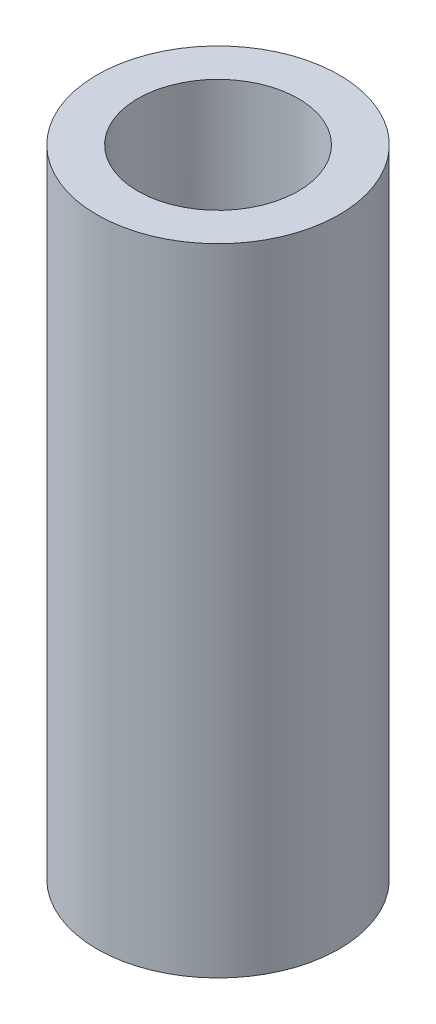
ISO-10303-21;
HEADER;
FILE_DESCRIPTION(('STEP AP214'),'2;1');
FILE_NAME('part.step','',(''),(''),'','','');
FILE_SCHEMA(('AUTOMOTIVE_DESIGN { 1 0 10303 214 1 1 1 1 }'));
ENDSEC;
DATA;
#1=APPLICATION_CONTEXT('core data for automotive mechanical design processes');
#2=APPLICATION_PROTOCOL_DEFINITION('international standard','automotive_design',2000,#1);
#3=PRODUCT_CONTEXT('',#1,'mechanical');
#4=PRODUCT('Part','Part','',(#3));
#5=PRODUCT_RELATED_PRODUCT_CATEGORY('part','',(#4));
#6=PRODUCT_DEFINITION_FORMATION('','',#4);
#7=PRODUCT_DEFINITION_CONTEXT('part definition',#1,'design');
#8=PRODUCT_DEFINITION('design','',#6,#7);
#9=PRODUCT_DEFINITION_SHAPE('','',#8);
#10=(LENGTH_UNIT() NAMED_UNIT(*) SI_UNIT(.MILLI.,.METRE.));
#11=(NAMED_UNIT(*) PLANE_ANGLE_UNIT() SI_UNIT($,.RADIAN.));
#12=(NAMED_UNIT(*) SI_UNIT($,.STERADIAN.) SOLID_ANGLE_UNIT());
#13=UNCERTAINTY_MEASURE_WITH_UNIT(LENGTH_MEASURE(1.E-05),#10,'distance_accuracy_value','');
#14=(GEOMETRIC_REPRESENTATION_CONTEXT(3) GLOBAL_UNCERTAINTY_ASSIGNED_CONTEXT((#13)) GLOBAL_UNIT_ASSIGNED_CONTEXT((#10,
#11,#12)) REPRESENTATION_CONTEXT('',''));
#15=CARTESIAN_POINT('',(0.,0.,0.));
#16=DIRECTION('',(0.,0.,1.));
#17=DIRECTION('',(1.,0.,0.));
#18=AXIS2_PLACEMENT_3D('',#15,#16,#17);
#19=CARTESIAN_POINT('',(0.,21.,0.));
#20=DIRECTION('',(0.,-1.,0.));
#21=DIRECTION('',(0.,0.,-1.));
#22=AXIS2_PLACEMENT_3D('',#19,#20,#21);
#23=CYLINDRICAL_SURFACE('',#22,4.);
#24=DIRECTION('',(0.,-1.,0.));
#25=VECTOR('',#24,1.);
#26=CARTESIAN_POINT('',(-3.99991645107305,21.,-0.0258531320189111));
#27=LINE('',#26,#25);
#28=CARTESIAN_POINT('',(-3.99991645107308,17.399761270919,-0.025853132018911));
#29=VERTEX_POINT('',#28);
#30=CARTESIAN_POINT('',(-3.99991645107308,14.600238729081,-0.025853132018911));
#31=VERTEX_POINT('',#30);
#32=EDGE_CURVE('E11',#29,#31,#27,.T.);
#33=ORIENTED_EDGE('',*,*,#32,.T.);
#34=CARTESIAN_POINT('',(-3.99991645107308,14.600238729081,-0.0258531320190421));
#35=CARTESIAN_POINT('',(-3.99967225830139,14.6009439988238,-0.0640921575293315));
#36=CARTESIAN_POINT('',(-3.99887347610365,14.6032187619792,-0.102278964228953));
#37=CARTESIAN_POINT('',(-3.99620499133585,14.6108738995903,-0.178292419562263));
#38=CARTESIAN_POINT('',(-3.99433556857381,14.6162534626206,-0.216119159673172));
#39=CARTESIAN_POINT('',(-3.98719610185074,14.6369488008378,-0.328422064505284));
#40=CARTESIAN_POINT('',(-3.98039240823535,14.6568271415164,-0.402013757078062));
#41=CARTESIAN_POINT('',(-3.96340813940453,14.7080320373958,-0.544576356502268));
#42=CARTESIAN_POINT('',(-3.95322930854667,14.7393526797706,-0.613549628185836));
#43=CARTESIAN_POINT('',(-3.93052020660311,14.8124834378182,-0.745307835813629));
#44=CARTESIAN_POINT('',(-3.91798857048058,14.8542996475161,-0.808089146927107));
#45=CARTESIAN_POINT('',(-3.89135352945277,14.9489240346771,-0.928050448785724));
#46=CARTESIAN_POINT('',(-3.8772106603566,15.0020634331421,-0.984960294435631));
#47=CARTESIAN_POINT('',(-3.84921378824501,15.1170764566808,-1.08925407411135));
#48=CARTESIAN_POINT('',(-3.83535986056662,15.1789523277724,-1.1366355509169));
#49=CARTESIAN_POINT('',(-3.80908699514521,15.3118854332206,-1.22184578759158));
#50=CARTESIAN_POINT('',(-3.79672101385227,15.3831561146456,-1.2593593716383));
#51=CARTESIAN_POINT('',(-3.77546131742445,15.5315120212514,-1.32173627746362));
#52=CARTESIAN_POINT('',(-3.76656616175619,15.6085948182841,-1.34660484873724));
#53=CARTESIAN_POINT('',(-3.75372261689463,15.7631109656046,-1.38199497149599));
#54=CARTESIAN_POINT('',(-3.74958979642407,15.840405738016,-1.39305292756278));
#55=CARTESIAN_POINT('',(-3.74619639341714,15.9958548095515,-1.40215536416123));
#56=CARTESIAN_POINT('',(-3.74693437342952,16.0740088482956,-1.40020368404321));
#57=CARTESIAN_POINT('',(-3.75302260858192,16.2249354068714,-1.38379454669174));
#58=CARTESIAN_POINT('',(-3.75814713768332,16.2977849538027,-1.36994900946075));
#59=CARTESIAN_POINT('',(-3.77208656020989,16.440062954669,-1.33108421220736));
#60=CARTESIAN_POINT('',(-3.78090196998585,16.5094909284095,-1.30606338874007));
#61=CARTESIAN_POINT('',(-3.8014547569224,16.6446909983725,-1.24498869082329));
#62=CARTESIAN_POINT('',(-3.81325163509311,16.7103504237503,-1.20870621983939));
#63=CARTESIAN_POINT('',(-3.83839332211351,16.8348584792766,-1.12631614578102));
#64=CARTESIAN_POINT('',(-3.85173858055954,16.8937051212682,-1.08020568572731));
#65=CARTESIAN_POINT('',(-3.87940616234065,17.0064550711861,-0.976347097309243));
#66=CARTESIAN_POINT('',(-3.89374063509772,17.0598814916565,-0.918083294265943));
#67=CARTESIAN_POINT('',(-3.92108981098457,17.156325832214,-0.79318088663264));
#68=CARTESIAN_POINT('',(-3.93410407430078,17.1993402902396,-0.726539507591292));
#69=CARTESIAN_POINT('',(-3.95748807810665,17.2739625280279,-0.586005200561402));
#70=CARTESIAN_POINT('',(-3.96783560070064,17.3054753314649,-0.51205802975848));
#71=CARTESIAN_POINT('',(-3.98454566226436,17.3554207033291,-0.359510885329969));
#72=CARTESIAN_POINT('',(-3.99091545014645,17.3738770736394,-0.280919662805801));
#73=CARTESIAN_POINT('',(-3.9963966045933,17.3896748938166,-0.172255891920458));
#74=CARTESIAN_POINT('',(-3.99754872485567,17.3929825667261,-0.143056897965824));
#75=CARTESIAN_POINT('',(-3.99921326658427,17.39775252398,-0.0845341011151192));
#76=CARTESIAN_POINT('',(-3.99972663497742,17.3992175400328,-0.0552105477894228));
#77=CARTESIAN_POINT('',(-3.99991645107305,17.399761270919,-0.0258531320190412));
#78=B_SPLINE_CURVE_WITH_KNOTS('',3,(#34,#35,#36,#37,#38,#39,#40,#41,#42,#43,#44,#45,#46,#47,#48,
#49,#50,#51,#52,#53,#54,#55,#56,#57,#58,#59,#60,#61,#62,#63,#64,#65,#66,#67,#68,#69,#70,#71,#72,
#73,#74,#75,#76,#77),.UNSPECIFIED.,.F.,.F.,(4,2,2,2,2,2,2,2,2,2,2,2,2,2,2,2,2,2,2,2,2,4),(0.,
0.114664507603254,0.229299061720669,0.457701131164789,0.685985340068443,0.9144024051538,
1.15074978367751,1.38715803462588,1.63038942015454,1.87351974714062,2.1068793264695,
2.34017004072909,2.56213147320374,2.78412396825833,3.01095516106762,3.23785238346189,
3.47775904339029,3.71774536497249,3.9596708177997,4.20115409590331,4.28932861164633,
4.37737225545862),.UNSPECIFIED.);
#79=EDGE_CURVE('E87',#31,#29,#78,.T.);
#80=ORIENTED_EDGE('',*,*,#79,.T.);
#81=EDGE_LOOP('',(#33,#80));
#82=FACE_BOUND('',#81,.T.);
#83=DIRECTION('',(0.,-1.,0.));
#84=VECTOR('',#83,1.);
#85=CARTESIAN_POINT('',(-3.99991645107305,21.,0.0258531320189111));
#86=LINE('',#85,#84);
#87=CARTESIAN_POINT('',(-3.99991645107308,14.600238729081,0.025853132018911));
#88=VERTEX_POINT('',#87);
#89=CARTESIAN_POINT('',(-3.99991645107308,17.399761270919,0.025853132018911));
#90=VERTEX_POINT('',#89);
#91=EDGE_CURVE('E48',#88,#90,#86,.F.);
#92=ORIENTED_EDGE('',*,*,#91,.T.);
#93=CARTESIAN_POINT('',(-3.99991645107308,17.399761270919,0.0258531320190421));
#94=CARTESIAN_POINT('',(-3.99967225830139,17.3990560011763,0.0640921575293312));
#95=CARTESIAN_POINT('',(-3.99887347610365,17.3967812380208,0.102278964228953));
#96=CARTESIAN_POINT('',(-3.99620499133585,17.3891261004098,0.178292419562263));
#97=CARTESIAN_POINT('',(-3.99433556857381,17.3837465373795,0.216119159673172));
#98=CARTESIAN_POINT('',(-3.98719610185074,17.3630511991623,0.328422064505283));
#99=CARTESIAN_POINT('',(-3.98039240823535,17.3431728584837,0.40201375707806));
#100=CARTESIAN_POINT('',(-3.96340813940453,17.2919679626042,0.544576356502268));
#101=CARTESIAN_POINT('',(-3.95322930854667,17.2606473202295,0.613549628185838));
#102=CARTESIAN_POINT('',(-3.93052020660311,17.1875165621819,0.74530783581363));
#103=CARTESIAN_POINT('',(-3.91798857048058,17.145700352484,0.808089146927105));
#104=CARTESIAN_POINT('',(-3.89135352945277,17.051075965323,0.928050448785722));
#105=CARTESIAN_POINT('',(-3.8772106603566,16.997936566858,0.98496029443563));
#106=CARTESIAN_POINT('',(-3.84921378824501,16.8829235433193,1.08925407411135));
#107=CARTESIAN_POINT('',(-3.83535986056663,16.8210476722277,1.13663555091689));
#108=CARTESIAN_POINT('',(-3.80908699514521,16.6881145667794,1.22184578759158));
#109=CARTESIAN_POINT('',(-3.79672101385227,16.6168438853544,1.25935937163829));
#110=CARTESIAN_POINT('',(-3.77546131742445,16.4684879787486,1.32173627746362));
#111=CARTESIAN_POINT('',(-3.76656616175619,16.391405181716,1.34660484873724));
#112=CARTESIAN_POINT('',(-3.75372261689463,16.2368890343955,1.38199497149599));
#113=CARTESIAN_POINT('',(-3.74958979642407,16.1595942619841,1.39305292756278));
#114=CARTESIAN_POINT('',(-3.74619639341714,16.0041451904485,1.40215536416123));
#115=CARTESIAN_POINT('',(-3.74693437342952,15.9259911517045,1.40020368404321));
#116=CARTESIAN_POINT('',(-3.75302260858192,15.7750645931286,1.38379454669174));
#117=CARTESIAN_POINT('',(-3.75814713768331,15.7022150461974,1.36994900946075));
#118=CARTESIAN_POINT('',(-3.77208656020989,15.5599370453311,1.33108421220736));
#119=CARTESIAN_POINT('',(-3.78090196998585,15.4905090715906,1.30606338874007));
#120=CARTESIAN_POINT('',(-3.8014547569224,15.3553090016275,1.24498869082329));
#121=CARTESIAN_POINT('',(-3.81325163509311,15.2896495762497,1.20870621983939));
#122=CARTESIAN_POINT('',(-3.83839332211351,15.1651415207234,1.12631614578102));
#123=CARTESIAN_POINT('',(-3.85173858055954,15.1062948787318,1.0802056857273));
#124=CARTESIAN_POINT('',(-3.87940616234065,14.993544928814,0.976347097309244));
#125=CARTESIAN_POINT('',(-3.89374063509773,14.9401185083435,0.918083294265944));
#126=CARTESIAN_POINT('',(-3.92108981098458,14.8436741677861,0.79318088663264));
#127=CARTESIAN_POINT('',(-3.93410407430078,14.8006597097605,0.726539507591293));
#128=CARTESIAN_POINT('',(-3.95748807810665,14.7260374719722,0.586005200561404));
#129=CARTESIAN_POINT('',(-3.96783560070064,14.6945246685351,0.512058029758483));
#130=CARTESIAN_POINT('',(-3.98454566226436,14.644579296671,0.359510885329972));
#131=CARTESIAN_POINT('',(-3.99091545014645,14.6261229263606,0.280919662805803));
#132=CARTESIAN_POINT('',(-3.9963966045933,14.6103251061834,0.17225589192046));
#133=CARTESIAN_POINT('',(-3.99754872485567,14.607017433274,0.143056897965826));
#134=CARTESIAN_POINT('',(-3.99921326658427,14.6022474760201,0.0845341011151206));
#135=CARTESIAN_POINT('',(-3.99972663497742,14.6007824599673,0.0552105477894235));
#136=CARTESIAN_POINT('',(-3.99991645107305,14.600238729081,0.0258531320190412));
#137=B_SPLINE_CURVE_WITH_KNOTS('',3,(#93,#94,#95,#96,#97,#98,#99,#100,#101,#102,#103,#104,#105,
#106,#107,#108,#109,#110,#111,#112,#113,#114,#115,#116,#117,#118,#119,#120,#121,#122,#123,#124,
#125,#126,#127,#128,#129,#130,#131,#132,#133,#134,#135,#136),.UNSPECIFIED.,.F.,.F.,(4,2,2,2,2,2,
2,2,2,2,2,2,2,2,2,2,2,2,2,2,2,4),(0.,0.114664507603254,0.229299061720668,0.457701131164788,
0.685985340068446,0.914402405153799,1.15074978367751,1.38715803462588,1.63038942015453,
1.87351974714062,2.1068793264695,2.34017004072909,2.56213147320374,2.78412396825833,
3.01095516106763,3.23785238346189,3.4777590433903,3.71774536497248,3.95967081779969,
4.20115409590331,4.28932861164633,4.37737225545862),.UNSPECIFIED.);
#138=EDGE_CURVE('E85',#90,#88,#137,.T.);
#139=ORIENTED_EDGE('',*,*,#138,.T.);
#140=EDGE_LOOP('',(#92,#139));
#141=FACE_BOUND('',#140,.T.);
#142=DIRECTION('',(0.,-1.,0.));
#143=VECTOR('',#142,1.);
#144=CARTESIAN_POINT('',(-3.99991645107305,21.,-0.0258531320189111));
#145=LINE('',#144,#143);
#146=CARTESIAN_POINT('',(-3.99991645107316,6.39976127091904,-0.025853132018911));
#147=VERTEX_POINT('',#146);
#148=CARTESIAN_POINT('',(-3.99991645107316,3.60023872908101,-0.025853132018911));
#149=VERTEX_POINT('',#148);
#150=EDGE_CURVE('E82',#147,#149,#145,.T.);
#151=ORIENTED_EDGE('',*,*,#150,.T.);
#152=CARTESIAN_POINT('',(-3.99991645107316,3.60023872908101,-0.0258531320189111));
#153=CARTESIAN_POINT('',(-3.99967225830142,3.60094399882377,-0.0640921575291983));
#154=CARTESIAN_POINT('',(-3.99887347610366,3.6032187619792,-0.102278964228819));
#155=CARTESIAN_POINT('',(-3.99620499133584,3.61087389959025,-0.178292419562128));
#156=CARTESIAN_POINT('',(-3.99433556857381,3.61625346262055,-0.216119159673037));
#157=CARTESIAN_POINT('',(-3.98719610185076,3.63694880083776,-0.328422064505149));
#158=CARTESIAN_POINT('',(-3.98039240823537,3.65682714151634,-0.402013757077929));
#159=CARTESIAN_POINT('',(-3.96340813940455,3.70803203739579,-0.544576356502139));
#160=CARTESIAN_POINT('',(-3.95322930854669,3.73935267977053,-0.61354962818571));
#161=CARTESIAN_POINT('',(-3.93052020660313,3.81248343781812,-0.745307835813509));
#162=CARTESIAN_POINT('',(-3.91798857048061,3.854299647516,-0.808089146926989));
#163=CARTESIAN_POINT('',(-3.8913535294528,3.94892403467695,-0.928050448785614));
#164=CARTESIAN_POINT('',(-3.87721066035663,4.00206343314195,-0.984960294435526));
#165=CARTESIAN_POINT('',(-3.84921378824504,4.11707645668067,-1.08925407411126));
#166=CARTESIAN_POINT('',(-3.83535986056665,4.17895232777225,-1.13663555091681));
#167=CARTESIAN_POINT('',(-3.80908699514523,4.31188543322051,-1.2218457875915));
#168=CARTESIAN_POINT('',(-3.79672101385229,4.38315611464547,-1.25935937163823));
#169=CARTESIAN_POINT('',(-3.77546131742447,4.53151202125127,-1.32173627746357));
#170=CARTESIAN_POINT('',(-3.76656616175621,4.60859481828395,-1.3466048487372));
#171=CARTESIAN_POINT('',(-3.75372261689464,4.76311096560443,-1.38199497149597));
#172=CARTESIAN_POINT('',(-3.74958979642408,4.84040573801585,-1.39305292756276));
#173=CARTESIAN_POINT('',(-3.74619639341714,4.99585480955136,-1.40215536416123));
#174=CARTESIAN_POINT('',(-3.74693437342952,5.07400884829543,-1.40020368404322));
#175=CARTESIAN_POINT('',(-3.75302260858191,5.22493540687129,-1.38379454669176));
#176=CARTESIAN_POINT('',(-3.7581471376833,5.29778495380255,-1.36994900946078));
#177=CARTESIAN_POINT('',(-3.77208656020987,5.44006295466883,-1.33108421220741));
#178=CARTESIAN_POINT('',(-3.78090196998583,5.50949092840937,-1.30606338874012));
#179=CARTESIAN_POINT('',(-3.80145475692238,5.6446909983724,-1.24498869082335));
#180=CARTESIAN_POINT('',(-3.81325163509309,5.71035042375019,-1.20870621983946));
#181=CARTESIAN_POINT('',(-3.83839332211348,5.83485847927652,-1.12631614578111));
#182=CARTESIAN_POINT('',(-3.85173858055951,5.8937051212681,-1.0802056857274));
#183=CARTESIAN_POINT('',(-3.87940616234062,6.00645507118598,-0.976347097309352));
#184=CARTESIAN_POINT('',(-3.8937406350977,6.05988149165643,-0.918083294266058));
#185=CARTESIAN_POINT('',(-3.92108981098455,6.15632583221387,-0.793180886632766));
#186=CARTESIAN_POINT('',(-3.93410407430075,6.19934029023948,-0.726539507591425));
#187=CARTESIAN_POINT('',(-3.95748807810663,6.27396252802781,-0.586005200561544));
#188=CARTESIAN_POINT('',(-3.96783560070062,6.30547533146489,-0.512058029758626));
#189=CARTESIAN_POINT('',(-3.98454566226434,6.35542070332904,-0.359510885330119));
#190=CARTESIAN_POINT('',(-3.99091545014644,6.37387707363939,-0.280919662805951));
#191=CARTESIAN_POINT('',(-3.9963966045933,6.3896748938166,-0.172255891920562));
#192=CARTESIAN_POINT('',(-3.99754872485567,6.3929825667261,-0.14305689796588));
#193=CARTESIAN_POINT('',(-3.99921326658427,6.39775252397999,-0.0845341011150808));
#194=CARTESIAN_POINT('',(-3.99972663497742,6.39921754003277,-0.0552105477893363));
#195=CARTESIAN_POINT('',(-3.99991645107305,6.39976127091905,-0.0258531320189066));
#196=B_SPLINE_CURVE_WITH_KNOTS('',3,(#152,#153,#154,#155,#156,#157,#158,#159,#160,#161,#162,
#163,#164,#165,#166,#167,#168,#169,#170,#171,#172,#173,#174,#175,#176,#177,#178,#179,#180,#181,
#182,#183,#184,#185,#186,#187,#188,#189,#190,#191,#192,#193,#194,#195),.UNSPECIFIED.,.F.,.F.,(4,
2,2,2,2,2,2,2,2,2,2,2,2,2,2,2,2,2,2,2,2,4),(0.,0.114664507603251,0.229299061720663,
0.457701131164782,0.685985340068434,0.914402405153786,1.15074978367749,1.38715803462586,
1.63038942015451,1.8735197471406,2.10687932646949,2.34017004072907,2.56213147320373,
2.78412396825832,3.01095516106761,3.23785238346187,3.47775904339027,3.71774536497246,
3.95967081779967,4.20115409590329,4.28932861164646,4.37737225545889),.UNSPECIFIED.);
#197=EDGE_CURVE('E177',#149,#147,#196,.T.);
#198=ORIENTED_EDGE('',*,*,#197,.T.);
#199=EDGE_LOOP('',(#151,#198));
#200=FACE_BOUND('',#199,.T.);
#201=DIRECTION('',(0.,-1.,0.));
#202=VECTOR('',#201,1.);
#203=CARTESIAN_POINT('',(-3.99991645107305,21.,0.0258531320189111));
#204=LINE('',#203,#202);
#205=CARTESIAN_POINT('',(-3.99991645107316,3.60023872908101,0.025853132018911));
#206=VERTEX_POINT('',#205);
#207=CARTESIAN_POINT('',(-3.99991645107316,6.39976127091904,0.025853132018911));
#208=VERTEX_POINT('',#207);
#209=EDGE_CURVE('E182',#206,#208,#204,.F.);
#210=ORIENTED_EDGE('',*,*,#209,.T.);
#211=CARTESIAN_POINT('',(-3.99991645107316,6.39976127091904,0.0258531320189111));
#212=CARTESIAN_POINT('',(-3.99967225830142,6.39905600117628,0.0640921575291982));
#213=CARTESIAN_POINT('',(-3.99887347610366,6.39678123802085,0.102278964228819));
#214=CARTESIAN_POINT('',(-3.99620499133584,6.38912610040981,0.178292419562127));
#215=CARTESIAN_POINT('',(-3.99433556857381,6.38374653737951,0.216119159673036));
#216=CARTESIAN_POINT('',(-3.98719610185076,6.3630511991623,0.328422064505149));
#217=CARTESIAN_POINT('',(-3.98039240823537,6.34317285848372,0.402013757077927));
#218=CARTESIAN_POINT('',(-3.96340813940455,6.29196796260427,0.544576356502137));
#219=CARTESIAN_POINT('',(-3.95322930854669,6.26064732022953,0.613549628185708));
#220=CARTESIAN_POINT('',(-3.93052020660313,6.18751656218193,0.745307835813506));
#221=CARTESIAN_POINT('',(-3.9179885704806,6.14570035248406,0.808089146926986));
#222=CARTESIAN_POINT('',(-3.8913535294528,6.0510759653231,0.928050448785611));
#223=CARTESIAN_POINT('',(-3.87721066035663,5.99793656685811,0.984960294435523));
#224=CARTESIAN_POINT('',(-3.84921378824504,5.88292354331939,1.08925407411126));
#225=CARTESIAN_POINT('',(-3.83535986056665,5.82104767222781,1.1366355509168));
#226=CARTESIAN_POINT('',(-3.80908699514524,5.68811456677954,1.2218457875915));
#227=CARTESIAN_POINT('',(-3.79672101385229,5.61684388535459,1.25935937163823));
#228=CARTESIAN_POINT('',(-3.77546131742447,5.46848797874879,1.32173627746357));
#229=CARTESIAN_POINT('',(-3.76656616175621,5.39140518171611,1.3466048487372));
#230=CARTESIAN_POINT('',(-3.75372261689464,5.23688903439562,1.38199497149597));
#231=CARTESIAN_POINT('',(-3.74958979642408,5.1595942619842,1.39305292756276));
#232=CARTESIAN_POINT('',(-3.74619639341714,5.00414519044869,1.40215536416123));
#233=CARTESIAN_POINT('',(-3.74693437342952,4.92599115170463,1.40020368404322));
#234=CARTESIAN_POINT('',(-3.75302260858191,4.77506459312876,1.38379454669176));
#235=CARTESIAN_POINT('',(-3.7581471376833,4.70221504619751,1.36994900946078));
#236=CARTESIAN_POINT('',(-3.77208656020987,4.55993704533122,1.33108421220741));
#237=CARTESIAN_POINT('',(-3.78090196998583,4.49050907159068,1.30606338874012));
#238=CARTESIAN_POINT('',(-3.80145475692238,4.35530900162765,1.24498869082335));
#239=CARTESIAN_POINT('',(-3.81325163509309,4.28964957624987,1.20870621983946));
#240=CARTESIAN_POINT('',(-3.83839332211348,4.16514152072353,1.12631614578111));
#241=CARTESIAN_POINT('',(-3.85173858055951,4.10629487873195,1.0802056857274));
#242=CARTESIAN_POINT('',(-3.87940616234062,3.99354492881407,0.976347097309353));
#243=CARTESIAN_POINT('',(-3.8937406350977,3.94011850834362,0.918083294266059));
#244=CARTESIAN_POINT('',(-3.92108981098455,3.84367416778618,0.793180886632768));
#245=CARTESIAN_POINT('',(-3.93410407430075,3.80065970976057,0.726539507591427));
#246=CARTESIAN_POINT('',(-3.95748807810663,3.72603747197224,0.586005200561547));
#247=CARTESIAN_POINT('',(-3.96783560070062,3.69452466853517,0.512058029758628));
#248=CARTESIAN_POINT('',(-3.98454566226434,3.64457929667102,0.359510885330122));
#249=CARTESIAN_POINT('',(-3.99091545014644,3.62612292636067,0.280919662805955));
#250=CARTESIAN_POINT('',(-3.9963966045933,3.61032510618346,0.172255891920565));
#251=CARTESIAN_POINT('',(-3.99754872485567,3.60701743327396,0.143056897965883));
#252=CARTESIAN_POINT('',(-3.99921326658427,3.60224747602007,0.0845341011150814));
#253=CARTESIAN_POINT('',(-3.99972663497742,3.60078245996728,0.0552105477893365));
#254=CARTESIAN_POINT('',(-3.99991645107305,3.60023872908101,0.0258531320189065));
#255=B_SPLINE_CURVE_WITH_KNOTS('',3,(#211,#212,#213,#214,#215,#216,#217,#218,#219,#220,#221,
#222,#223,#224,#225,#226,#227,#228,#229,#230,#231,#232,#233,#234,#235,#236,#237,#238,#239,#240,
#241,#242,#243,#244,#245,#246,#247,#248,#249,#250,#251,#252,#253,#254),.UNSPECIFIED.,.F.,.F.,(4,
2,2,2,2,2,2,2,2,2,2,2,2,2,2,2,2,2,2,2,2,4),(0.,0.114664507603251,0.229299061720663,
0.457701131164781,0.685985340068431,0.914402405153782,1.15074978367749,1.38715803462585,
1.63038942015451,1.8735197471406,2.10687932646949,2.34017004072907,2.56213147320373,
2.78412396825832,3.01095516106761,3.23785238346187,3.47775904339027,3.71774536497246,
3.95967081779967,4.20115409590329,4.28932861164646,4.37737225545889),.UNSPECIFIED.);
#256=EDGE_CURVE('E174',#208,#206,#255,.T.);
#257=ORIENTED_EDGE('',*,*,#256,.T.);
#258=EDGE_LOOP('',(#210,#257));
#259=FACE_BOUND('',#258,.T.);
#260=CARTESIAN_POINT('',(0.,21.,0.));
#261=DIRECTION('',(0.,1.,0.));
#262=DIRECTION('',(0.,0.,1.));
#263=AXIS2_PLACEMENT_3D('',#260,#261,#262);
#264=CIRCLE('',#263,4.);
#265=CARTESIAN_POINT('',(0.,21.,4.));
#266=VERTEX_POINT('',#265);
#267=EDGE_CURVE('E222',#266,#266,#264,.T.);
#268=ORIENTED_EDGE('',*,*,#267,.F.);
#269=EDGE_LOOP('',(#268));
#270=FACE_BOUND('',#269,.T.);
#271=CARTESIAN_POINT('',(0.,0.,0.));
#272=DIRECTION('',(0.,1.,0.));
#273=DIRECTION('',(0.,0.,1.));
#274=AXIS2_PLACEMENT_3D('',#271,#272,#273);
#275=CIRCLE('',#274,4.);
#276=CARTESIAN_POINT('',(0.,0.,4.));
#277=VERTEX_POINT('',#276);
#278=EDGE_CURVE('E128',#277,#277,#275,.T.);
#279=ORIENTED_EDGE('',*,*,#278,.T.);
#280=EDGE_LOOP('',(#279));
#281=FACE_BOUND('',#280,.T.);
#282=ADVANCED_FACE('F39',(#82,#141,#200,#259,#270,#281),#23,.T.);
#283=CARTESIAN_POINT('',(0.,21.,0.));
#284=DIRECTION('',(0.,1.,0.));
#285=DIRECTION('',(0.,0.,1.));
#286=AXIS2_PLACEMENT_3D('',#283,#284,#285);
#287=PLANE('',#286);
#288=CARTESIAN_POINT('',(0.,21.,0.));
#289=DIRECTION('',(0.,1.,0.));
#290=DIRECTION('',(0.,0.,1.));
#291=AXIS2_PLACEMENT_3D('',#288,#289,#290);
#292=CIRCLE('',#291,2.65);
#293=CARTESIAN_POINT('',(0.,21.,2.65));
#294=VERTEX_POINT('',#293);
#295=EDGE_CURVE('E186',#294,#294,#292,.T.);
#296=ORIENTED_EDGE('',*,*,#295,.F.);
#297=EDGE_LOOP('',(#296));
#298=FACE_BOUND('',#297,.T.);
#299=ORIENTED_EDGE('',*,*,#267,.T.);
#300=EDGE_LOOP('',(#299));
#301=FACE_BOUND('',#300,.T.);
#302=ADVANCED_FACE('F151',(#298,#301),#287,.T.);
#303=CARTESIAN_POINT('',(0.,0.,0.));
#304=DIRECTION('',(0.,1.,0.));
#305=DIRECTION('',(0.,0.,1.));
#306=AXIS2_PLACEMENT_3D('',#303,#304,#305);
#307=PLANE('',#306);
#308=CARTESIAN_POINT('',(0.,0.,0.));
#309=DIRECTION('',(0.,-1.,0.));
#310=DIRECTION('',(0.,0.,-1.));
#311=AXIS2_PLACEMENT_3D('',#308,#309,#310);
#312=CIRCLE('',#311,3.2);
#313=CARTESIAN_POINT('',(0.,0.,-3.2));
#314=VERTEX_POINT('',#313);
#315=EDGE_CURVE('E213',#314,#314,#312,.T.);
#316=ORIENTED_EDGE('',*,*,#315,.F.);
#317=EDGE_LOOP('',(#316));
#318=FACE_BOUND('',#317,.T.);
#319=ORIENTED_EDGE('',*,*,#278,.F.);
#320=EDGE_LOOP('',(#319));
#321=FACE_BOUND('',#320,.T.);
#322=ADVANCED_FACE('F149',(#318,#321),#307,.F.);
#323=CARTESIAN_POINT('',(0.,10.,0.));
#324=DIRECTION('',(0.,-1.,0.));
#325=DIRECTION('',(0.,0.,-1.));
#326=AXIS2_PLACEMENT_3D('',#323,#324,#325);
#327=CYLINDRICAL_SURFACE('',#326,3.2);
#328=CARTESIAN_POINT('',(-3.2,3.60000000000002,0.));
#329=CARTESIAN_POINT('',(-3.19999323929896,3.60000882862046,0.0746682325298775));
#330=CARTESIAN_POINT('',(-3.19735695673799,3.60600835816502,0.149436290609146));
#331=CARTESIAN_POINT('',(-3.18706462250722,3.62978490809575,0.296838561834425));
#332=CARTESIAN_POINT('',(-3.17939623551487,3.64759087100718,0.369467071934258));
#333=CARTESIAN_POINT('',(-3.15985979638772,3.69418283092299,0.510210727685957));
#334=CARTESIAN_POINT('',(-3.14800655397558,3.72293013541371,0.57834079637958));
#335=CARTESIAN_POINT('',(-3.12123780515295,3.79042054568872,0.708739295318285));
#336=CARTESIAN_POINT('',(-3.10632305462494,3.82916118473621,0.7710091669143));
#337=CARTESIAN_POINT('',(-3.07400114777708,3.91774957634818,0.891399307299581));
#338=CARTESIAN_POINT('',(-3.05650709697098,3.96805267426737,0.949160930428645));
#339=CARTESIAN_POINT('',(-3.02135131890907,4.07737245601193,1.05574232998401));
#340=CARTESIAN_POINT('',(-3.00368950092187,4.13639413946651,1.10455693955992));
#341=CARTESIAN_POINT('',(-2.9690927777526,4.26543856539599,1.19454701616179));
#342=CARTESIAN_POINT('',(-2.95225267260003,4.33589015374362,1.23514788937881));
#343=CARTESIAN_POINT('',(-2.92260314752168,4.48346132572815,1.30376311363399));
#344=CARTESIAN_POINT('',(-2.9097914452503,4.56057710199087,1.3317845955581));
#345=CARTESIAN_POINT('',(-2.89059965408317,4.71516169742201,1.37292682646117));
#346=CARTESIAN_POINT('',(-2.88392212034105,4.79240748537646,1.38674110526249));
#347=CARTESIAN_POINT('',(-2.87691007594234,4.94838677799436,1.40123529298112));
#348=CARTESIAN_POINT('',(-2.87657152755454,5.02711930365459,1.40192356275211));
#349=CARTESIAN_POINT('',(-2.88202665013976,5.17658359891195,1.39066469697343));
#350=CARTESIAN_POINT('',(-2.88729445733953,5.24742021626037,1.37980117002711));
#351=CARTESIAN_POINT('',(-2.90247226483301,5.38614010882635,1.34757876598954));
#352=CARTESIAN_POINT('',(-2.91238326673219,5.45402274337172,1.32621762435952));
#353=CARTESIAN_POINT('',(-2.93595952759738,5.58670579267017,1.2731835971743));
#354=CARTESIAN_POINT('',(-2.94970322228104,5.65140437146944,1.24129238704281));
#355=CARTESIAN_POINT('',(-2.97938258432282,5.77479985933511,1.16825974889634));
#356=CARTESIAN_POINT('',(-2.99531916026687,5.83349426299944,1.12711448210096));
#357=CARTESIAN_POINT('',(-3.02940997516427,5.94902819970128,1.03220450369383));
#358=CARTESIAN_POINT('',(-3.04763179448214,6.00517368661696,0.977616720899959));
#359=CARTESIAN_POINT('',(-3.08298711786831,6.10775987826215,0.859639861912725));
#360=CARTESIAN_POINT('',(-3.10012031174763,6.15419782551534,0.796248293446521));
#361=CARTESIAN_POINT('',(-3.13196210037405,6.23721440381238,0.66016925228355));
#362=CARTESIAN_POINT('',(-3.14659001099467,6.2734829128974,0.587272278263271));
#363=CARTESIAN_POINT('',(-3.17114037284155,6.33299309785246,0.435607390856095));
#364=CARTESIAN_POINT('',(-3.18106569682268,6.35624272838524,0.356843095870493));
#365=CARTESIAN_POINT('',(-3.1945388332546,6.38753830009636,0.201455047470969));
#366=CARTESIAN_POINT('',(-3.19847581943999,6.39651393340044,0.125052333509547));
#367=CARTESIAN_POINT('',(-3.2007922664932,6.40181271555229,-0.0282640651341215));
#368=CARTESIAN_POINT('',(-3.19917353770823,6.39813998590759,-0.10517757521984));
#369=CARTESIAN_POINT('',(-3.19080873687224,6.37888616161881,-0.252793729037831));
#370=CARTESIAN_POINT('',(-3.18435437244214,6.36398229289883,-0.323603206184578));
#371=CARTESIAN_POINT('',(-3.1672925050764,6.3236594347154,-0.461624114121053));
#372=CARTESIAN_POINT('',(-3.15668449196048,6.29823915353068,-0.52883510176584));
#373=CARTESIAN_POINT('',(-3.13190520783963,6.23678768417317,-0.660132529349556));
#374=CARTESIAN_POINT('',(-3.11763295400634,6.20044975949184,-0.724055715670428));
#375=CARTESIAN_POINT('',(-3.08701554400474,6.11852910687444,-0.845127836893712));
#376=CARTESIAN_POINT('',(-3.07066949286605,6.07294238239581,-0.902273826296681));
#377=CARTESIAN_POINT('',(-3.03606354570034,5.96965439698898,-1.0128843281988));
#378=CARTESIAN_POINT('',(-3.01775402187564,5.91128397486417,-1.06571002168735));
#379=CARTESIAN_POINT('',(-2.98238476439398,5.78626291589081,-1.16102178855706));
#380=CARTESIAN_POINT('',(-2.96532543173475,5.71960964064346,-1.20350455451119));
#381=CARTESIAN_POINT('',(-2.93414786375579,5.57799844717799,-1.27766771000143));
#382=CARTESIAN_POINT('',(-2.92009882997794,5.50289565303897,-1.30910280610461));
#383=CARTESIAN_POINT('',(-2.89741141326388,5.34764857374586,-1.35858805747395));
#384=CARTESIAN_POINT('',(-2.88876794930699,5.26750910109906,-1.37665078517921));
#385=CARTESIAN_POINT('',(-2.87870059545969,5.11161889436916,-1.39757122414597));
#386=CARTESIAN_POINT('',(-2.87673758203622,5.03605511942191,-1.40156534379494));
#387=CARTESIAN_POINT('',(-2.87879673024831,4.88536230259502,-1.39733172107155));
#388=CARTESIAN_POINT('',(-2.8828177181642,4.81023317836314,-1.38910637546167));
#389=CARTESIAN_POINT('',(-2.89587822994622,4.66694548881129,-1.36165261619709));
#390=CARTESIAN_POINT('',(-2.90462124077084,4.59863295391721,-1.34307241616426));
#391=CARTESIAN_POINT('',(-2.92587878716624,4.46609672226217,-1.29610727139735));
#392=CARTESIAN_POINT('',(-2.93839440474458,4.40187420495353,-1.26771951345155));
#393=CARTESIAN_POINT('',(-2.96676558143144,4.2748988493906,-1.19988864897201));
#394=CARTESIAN_POINT('',(-2.98278224731329,4.21249548508154,-1.1598601773472));
#395=CARTESIAN_POINT('',(-3.0159494898889,4.09493768917059,-1.0706593907491));
#396=CARTESIAN_POINT('',(-3.03310051918632,4.03978617755641,-1.02148341162247));
#397=CARTESIAN_POINT('',(-3.06832603234553,3.93353609988187,-0.910514271123461));
#398=CARTESIAN_POINT('',(-3.08635772876448,3.88316263349807,-0.848009730462911));
#399=CARTESIAN_POINT('',(-3.11990113043651,3.79355326264327,-0.714792550563451));
#400=CARTESIAN_POINT('',(-3.13541168934315,3.75432241863165,-0.644076202378754));
#401=CARTESIAN_POINT('',(-3.16200691540381,3.68882772121614,-0.497203699003514));
#402=CARTESIAN_POINT('',(-3.17314582493306,3.66240392533636,-0.42112899753792));
#403=CARTESIAN_POINT('',(-3.18995281447474,3.6230014036058,-0.265147894197037));
#404=CARTESIAN_POINT('',(-3.19563769617754,3.60998137696073,-0.18525406117933));
#405=CARTESIAN_POINT('',(-3.19942859954671,3.60130795436467,-0.0699772697921454));
#406=CARTESIAN_POINT('',(-3.20000316897606,3.59999586171811,-0.0349996013486818));
#407=CARTESIAN_POINT('',(-3.2,3.60000000000002,0.));
#408=B_SPLINE_CURVE_WITH_KNOTS('',3,(#328,#329,#330,#331,#332,#333,#334,#335,#336,#337,#338,
#339,#340,#341,#342,#343,#344,#345,#346,#347,#348,#349,#350,#351,#352,#353,#354,#355,#356,#357,
#358,#359,#360,#361,#362,#363,#364,#365,#366,#367,#368,#369,#370,#371,#372,#373,#374,#375,#376,
#377,#378,#379,#380,#381,#382,#383,#384,#385,#386,#387,#388,#389,#390,#391,#392,#393,#394,#395,
#396,#397,#398,#399,#400,#401,#402,#403,#404,#405,#406,#407),.UNSPECIFIED.,.T.,.F.,(4,2,2,2,2,2,
2,2,2,2,2,2,2,2,2,2,2,2,2,2,2,2,2,2,2,2,2,2,2,2,2,2,2,2,2,2,2,2,2,4),(0.,0.22389784388117,
0.448346594706908,0.672008880095001,0.895616009826726,1.1303060725882,1.36513124343025,
1.61299389023415,1.86071585303957,2.09567060708281,2.33047569735744,2.54504901527542,
2.75966864114528,2.97905125230743,3.19852503646187,3.43864747577074,3.67883803068161,
3.92570866035185,4.17242828458789,4.4023023507457,4.63210151882834,4.84905357520543,
5.06603228751983,5.28979086692528,5.5136463424347,5.7550333097822,5.99649736596454,
6.24302657717685,6.48932371106909,6.7152018646058,6.94103571957449,7.15410460735167,
7.3672346628778,7.59383609576229,7.82052849302986,8.06618640407504,8.3119557037418,
8.55457109012829,8.7964366520339,8.90138537002498),.UNSPECIFIED.);
#409=CARTESIAN_POINT('',(-3.2,3.60000000000002,0.));
#410=VERTEX_POINT('',#409);
#411=EDGE_CURVE('E97',#410,#410,#408,.T.);
#412=ORIENTED_EDGE('',*,*,#411,.T.);
#413=EDGE_LOOP('',(#412));
#414=FACE_BOUND('',#413,.T.);
#415=CARTESIAN_POINT('',(0.,10.,0.));
#416=DIRECTION('',(0.,-1.,0.));
#417=DIRECTION('',(0.,0.,-1.));
#418=AXIS2_PLACEMENT_3D('',#415,#416,#417);
#419=CIRCLE('',#418,3.2);
#420=CARTESIAN_POINT('',(0.,10.,-3.2));
#421=VERTEX_POINT('',#420);
#422=EDGE_CURVE('E211',#421,#421,#419,.T.);
#423=ORIENTED_EDGE('',*,*,#422,.F.);
#424=EDGE_LOOP('',(#423));
#425=FACE_BOUND('',#424,.T.);
#426=ORIENTED_EDGE('',*,*,#315,.T.);
#427=EDGE_LOOP('',(#426));
#428=FACE_BOUND('',#427,.T.);
#429=ADVANCED_FACE('F144',(#414,#425,#428),#327,.F.);
#430=CARTESIAN_POINT('',(0.,10.,0.));
#431=DIRECTION('',(0.,-1.,0.));
#432=DIRECTION('',(0.,0.,-1.));
#433=AXIS2_PLACEMENT_3D('',#430,#431,#432);
#434=PLANE('',#433);
#435=ORIENTED_EDGE('',*,*,#422,.T.);
#436=EDGE_LOOP('',(#435));
#437=FACE_BOUND('',#436,.T.);
#438=ADVANCED_FACE('F141',(#437),#434,.T.);
#439=CARTESIAN_POINT('',(0.,11.,0.));
#440=DIRECTION('',(0.,1.,0.));
#441=DIRECTION('',(0.,0.,1.));
#442=AXIS2_PLACEMENT_3D('',#439,#440,#441);
#443=CYLINDRICAL_SURFACE('',#442,2.65);
#444=CARTESIAN_POINT('',(-2.65,14.6,0.));
#445=CARTESIAN_POINT('',(-2.64999577189303,14.6000047582389,0.0730918596093699));
#446=CARTESIAN_POINT('',(-2.6469444475611,14.6057573984712,0.146255423456193));
#447=CARTESIAN_POINT('',(-2.63503837184261,14.6284981285547,0.290388093187511));
#448=CARTESIAN_POINT('',(-2.62617431564432,14.6455042329437,0.361353489262464));
#449=CARTESIAN_POINT('',(-2.60356279429746,14.6898850535608,0.498791745612269));
#450=CARTESIAN_POINT('',(-2.58983499707556,14.7172180392183,0.565281434615352));
#451=CARTESIAN_POINT('',(-2.55872773439075,14.7812427946788,0.692614348178071));
#452=CARTESIAN_POINT('',(-2.54134829639051,14.8179344940988,0.753457615197434));
#453=CARTESIAN_POINT('',(-2.50316723503044,14.9023412423983,0.872235647522536));
#454=CARTESIAN_POINT('',(-2.48221629217821,14.9506194337555,0.92972143919834));
#455=CARTESIAN_POINT('',(-2.43968873145058,15.0556029806689,1.0362009777878));
#456=CARTESIAN_POINT('',(-2.41811159505586,15.1123154903546,1.08518743824807));
#457=CARTESIAN_POINT('',(-2.3745377538269,15.2385898963478,1.17767162159306));
#458=CARTESIAN_POINT('',(-2.35267483312807,15.3088463396701,1.22029193968227));
#459=CARTESIAN_POINT('',(-2.31355256688249,15.456780066424,1.29293742729674));
#460=CARTESIAN_POINT('',(-2.29628970023809,15.5344516117697,1.32297224050031));
#461=CARTESIAN_POINT('',(-2.2700241567852,15.6901461444846,1.36752570973012));
#462=CARTESIAN_POINT('',(-2.26057432078803,15.7678465068511,1.38289358429264));
#463=CARTESIAN_POINT('',(-2.24987925007335,15.9252471748968,1.40023568931706));
#464=CARTESIAN_POINT('',(-2.24862403477205,16.0049449290005,1.40222621272189));
#465=CARTESIAN_POINT('',(-2.25410933012106,16.1522701599505,1.39337704024839));
#466=CARTESIAN_POINT('',(-2.2597751927794,16.22005184218,1.3842622078646));
#467=CARTESIAN_POINT('',(-2.27655663049769,16.3529284395563,1.3564846972625));
#468=CARTESIAN_POINT('',(-2.287674319269,16.4180223019951,1.33781831571921));
#469=CARTESIAN_POINT('',(-2.31432656129896,16.5455204062307,1.29117160033067));
#470=CARTESIAN_POINT('',(-2.32995553133549,16.6078302204778,1.26298971203019));
#471=CARTESIAN_POINT('',(-2.36388852953691,16.7271499563548,1.19827580222235));
#472=CARTESIAN_POINT('',(-2.38219374789574,16.7841575013817,1.16174006145174));
#473=CARTESIAN_POINT('',(-2.4225887191349,16.8998817854952,1.07524569020352));
#474=CARTESIAN_POINT('',(-2.44484421427181,16.9576659714207,1.024112447992));
#475=CARTESIAN_POINT('',(-2.48852782533097,17.0642538285031,0.91285433692727));
#476=CARTESIAN_POINT('',(-2.5099554481519,17.1130522107191,0.852724210107422));
#477=CARTESIAN_POINT('',(-2.5510604959837,17.2029545948178,0.720848679595897));
#478=CARTESIAN_POINT('',(-2.57056678984465,17.2434559363318,0.648634593990565));
#479=CARTESIAN_POINT('',(-2.60410400229213,17.3113860937891,0.497132497410433));
#480=CARTESIAN_POINT('',(-2.61813972549898,17.3388263855257,0.417850769259775));
#481=CARTESIAN_POINT('',(-2.63808012290498,17.3773933815694,0.26200629606266));
#482=CARTESIAN_POINT('',(-2.64459650653073,17.3897530640841,0.185827982566278));
#483=CARTESIAN_POINT('',(-2.65091645362864,17.4017442952858,0.0322144503484426));
#484=CARTESIAN_POINT('',(-2.65072378387182,17.4013829861212,-0.0452200386877421));
#485=CARTESIAN_POINT('',(-2.64397675761285,17.3885731081405,-0.191824237662922));
#486=CARTESIAN_POINT('',(-2.63798782831534,17.3771988184461,-0.261118119489807));
#487=CARTESIAN_POINT('',(-2.62103676693864,17.3444440113891,-0.396651070384703));
#488=CARTESIAN_POINT('',(-2.61007411306046,17.3230624441444,-0.462889818131738));
#489=CARTESIAN_POINT('',(-2.58379783303193,17.2704498603422,-0.592428716513136));
#490=CARTESIAN_POINT('',(-2.56838002370812,17.2389807503142,-0.655610257616832));
#491=CARTESIAN_POINT('',(-2.53461328949422,17.167373494967,-0.77598299831371));
#492=CARTESIAN_POINT('',(-2.51626320198575,17.1272319088681,-0.833171806895412));
#493=CARTESIAN_POINT('',(-2.47604652213911,17.0345207344514,-0.946401206317679));
#494=CARTESIAN_POINT('',(-2.45401348390125,16.9810835534446,-1.0016732402617));
#495=CARTESIAN_POINT('',(-2.41024013166375,16.865795766683,-1.10285444715659));
#496=CARTESIAN_POINT('',(-2.38850009434624,16.8039377477642,-1.1487552802944));
#497=CARTESIAN_POINT('',(-2.34631509039301,16.6686416891631,-1.23274297419949));
#498=CARTESIAN_POINT('',(-2.32604328478519,16.5947148019476,-1.27013760654131));
#499=CARTESIAN_POINT('',(-2.29143674897232,16.4402354217049,-1.3315691589889));
#500=CARTESIAN_POINT('',(-2.27709366296111,16.3596924466195,-1.35562489509218));
#501=CARTESIAN_POINT('',(-2.25789821215772,16.2026394216938,-1.38733906176412));
#502=CARTESIAN_POINT('',(-2.25225377482025,16.126507210017,-1.39637292976713));
#503=CARTESIAN_POINT('',(-2.24886035736861,15.9736349428361,-1.40183570460548));
#504=CARTESIAN_POINT('',(-2.25110635446285,15.8968953050342,-1.39827263023172));
#505=CARTESIAN_POINT('',(-2.26236444301941,15.754550827509,-1.37996185703929));
#506=CARTESIAN_POINT('',(-2.27055164671731,15.6886960618913,-1.36657567006089));
#507=CARTESIAN_POINT('',(-2.29168861433603,15.560280501083,-1.3308237810083));
#508=CARTESIAN_POINT('',(-2.30464009791853,15.4977209046128,-1.30845483634985));
#509=CARTESIAN_POINT('',(-2.33486202766517,15.3731220995564,-1.25377530200353));
#510=CARTESIAN_POINT('',(-2.35235881689676,15.3113821174165,-1.22091213181732));
#511=CARTESIAN_POINT('',(-2.3893964443372,15.1938794562338,-1.14673586612915));
#512=CARTESIAN_POINT('',(-2.40893838033314,15.1381200202602,-1.10541822097864));
#513=CARTESIAN_POINT('',(-2.45115977849783,15.0259601435283,-1.00869934526047));
#514=CARTESIAN_POINT('',(-2.47389301885392,14.9705785084168,-0.952133663118936));
#515=CARTESIAN_POINT('',(-2.51749742659173,14.8697968565051,-0.830005903324899));
#516=CARTESIAN_POINT('',(-2.53836741948207,14.8244031095023,-0.764438216449191));
#517=CARTESIAN_POINT('',(-2.57649528539906,14.7441732178801,-0.624151630665279));
#518=CARTESIAN_POINT('',(-2.59366669442257,14.7095827040128,-0.549267477361699));
#519=CARTESIAN_POINT('',(-2.62178439623349,14.6539556441151,-0.393637682454707));
#520=CARTESIAN_POINT('',(-2.63274748310338,14.6328825116044,-0.31290852667961));
#521=CARTESIAN_POINT('',(-2.64326246221717,14.6127871894596,-0.192707174645605));
#522=CARTESIAN_POINT('',(-2.6457806383992,14.6080006632401,-0.15437381716864));
#523=CARTESIAN_POINT('',(-2.64915054054298,14.6016057821373,-0.0773670085643357));
#524=CARTESIAN_POINT('',(-2.65000223828586,14.5999974810716,-0.0386935516891504));
#525=CARTESIAN_POINT('',(-2.65,14.6,0.));
#526=B_SPLINE_CURVE_WITH_KNOTS('',3,(#444,#445,#446,#447,#448,#449,#450,#451,#452,#453,#454,
#455,#456,#457,#458,#459,#460,#461,#462,#463,#464,#465,#466,#467,#468,#469,#470,#471,#472,#473,
#474,#475,#476,#477,#478,#479,#480,#481,#482,#483,#484,#485,#486,#487,#488,#489,#490,#491,#492,
#493,#494,#495,#496,#497,#498,#499,#500,#501,#502,#503,#504,#505,#506,#507,#508,#509,#510,#511,
#512,#513,#514,#515,#516,#517,#518,#519,#520,#521,#522,#523,#524,#525),.UNSPECIFIED.,.T.,.F.,(4,
2,2,2,2,2,2,2,2,2,2,2,2,2,2,2,2,2,2,2,2,2,2,2,2,2,2,2,2,2,2,2,2,2,2,2,2,2,2,2,4),(0.,
0.219119335145638,0.438590287672515,0.657183690139117,0.875775448702992,1.10863333929339,
1.34168988238757,1.59550297771612,1.84912123082736,2.08695767967,2.32450440306377,
2.52942052284982,2.7344161529462,2.94405904243754,3.15379545052859,3.39368492922546,
3.6337151559199,3.88752716071033,4.14111574582806,4.37216991478714,4.60309436140572,
4.81354917853093,5.02402607981337,5.23989023273337,5.45584018692457,5.69475025483679,
5.93387202055122,6.18836955055718,6.4425071642282,6.6717494547578,6.90084584361818,
7.10305912468039,7.30534546614164,7.52080580638229,7.73638239974196,7.98236435246791,
8.22850028014998,8.4798820385653,8.7305804974642,8.84657647568917,8.96257441808471),.UNSPECIFIED.);
#527=CARTESIAN_POINT('',(-2.65,14.6,0.));
#528=VERTEX_POINT('',#527);
#529=EDGE_CURVE('E93',#528,#528,#526,.T.);
#530=ORIENTED_EDGE('',*,*,#529,.T.);
#531=EDGE_LOOP('',(#530));
#532=FACE_BOUND('',#531,.T.);
#533=CARTESIAN_POINT('',(0.,11.,0.));
#534=DIRECTION('',(0.,1.,0.));
#535=DIRECTION('',(0.,0.,1.));
#536=AXIS2_PLACEMENT_3D('',#533,#534,#535);
#537=CIRCLE('',#536,2.65);
#538=CARTESIAN_POINT('',(0.,11.,2.65));
#539=VERTEX_POINT('',#538);
#540=EDGE_CURVE('E215',#539,#539,#537,.T.);
#541=ORIENTED_EDGE('',*,*,#540,.F.);
#542=EDGE_LOOP('',(#541));
#543=FACE_BOUND('',#542,.T.);
#544=ORIENTED_EDGE('',*,*,#295,.T.);
#545=EDGE_LOOP('',(#544));
#546=FACE_BOUND('',#545,.T.);
#547=ADVANCED_FACE('F135',(#532,#543,#546),#443,.F.);
#548=CARTESIAN_POINT('',(0.,11.,0.));
#549=DIRECTION('',(0.,1.,0.));
#550=DIRECTION('',(0.,0.,1.));
#551=AXIS2_PLACEMENT_3D('',#548,#549,#550);
#552=PLANE('',#551);
#553=ORIENTED_EDGE('',*,*,#540,.T.);
#554=EDGE_LOOP('',(#553));
#555=FACE_BOUND('',#554,.T.);
#556=ADVANCED_FACE('F140',(#555),#552,.T.);
#557=CARTESIAN_POINT('',(-3.99991645107308,16.,0.));
#558=DIRECTION('',(-1.,0.,0.));
#559=DIRECTION('',(0.,-1.,0.));
#560=AXIS2_PLACEMENT_3D('',#557,#558,#559);
#561=PLANE('',#560);
#562=CARTESIAN_POINT('',(-3.99991645107308,16.,0.));
#563=DIRECTION('',(-1.,0.,0.));
#564=DIRECTION('',(0.,-1.,0.));
#565=AXIS2_PLACEMENT_3D('',#562,#563,#564);
#566=CIRCLE('',#565,1.4);
#567=EDGE_CURVE('E60',#90,#29,#566,.T.);
#568=ORIENTED_EDGE('',*,*,#567,.F.);
#569=ORIENTED_EDGE('',*,*,#91,.F.);
#570=EDGE_CURVE('E55',#31,#88,#566,.T.);
#571=ORIENTED_EDGE('',*,*,#570,.F.);
#572=ORIENTED_EDGE('',*,*,#32,.F.);
#573=EDGE_LOOP('',(#568,#569,#571,#572));
#574=FACE_BOUND('',#573,.T.);
#575=ADVANCED_FACE('F78',(#574),#561,.F.);
#576=CARTESIAN_POINT('',(-1.99991645107308,16.,0.));
#577=DIRECTION('',(-1.,0.,0.));
#578=DIRECTION('',(0.,-1.,0.));
#579=AXIS2_PLACEMENT_3D('',#576,#577,#578);
#580=CYLINDRICAL_SURFACE('',#579,1.4);
#581=ORIENTED_EDGE('',*,*,#529,.F.);
#582=EDGE_LOOP('',(#581));
#583=FACE_BOUND('',#582,.T.);
#584=ORIENTED_EDGE('',*,*,#570,.T.);
#585=ORIENTED_EDGE('',*,*,#138,.F.);
#586=ORIENTED_EDGE('',*,*,#567,.T.);
#587=ORIENTED_EDGE('',*,*,#79,.F.);
#588=EDGE_LOOP('',(#584,#585,#586,#587));
#589=FACE_BOUND('',#588,.T.);
#590=ADVANCED_FACE('F84',(#583,#589),#580,.F.);
#591=CARTESIAN_POINT('',(-3.99991645107316,5.00000000000003,0.));
#592=DIRECTION('',(-1.,0.,0.));
#593=DIRECTION('',(0.,-1.,0.));
#594=AXIS2_PLACEMENT_3D('',#591,#592,#593);
#595=PLANE('',#594);
#596=CARTESIAN_POINT('',(-3.99991645107316,5.00000000000003,0.));
#597=DIRECTION('',(-1.,0.,0.));
#598=DIRECTION('',(0.,-1.,0.));
#599=AXIS2_PLACEMENT_3D('',#596,#597,#598);
#600=CIRCLE('',#599,1.4);
#601=EDGE_CURVE('E89',#208,#147,#600,.T.);
#602=ORIENTED_EDGE('',*,*,#601,.F.);
#603=ORIENTED_EDGE('',*,*,#209,.F.);
#604=EDGE_CURVE('E107',#149,#206,#600,.T.);
#605=ORIENTED_EDGE('',*,*,#604,.F.);
#606=ORIENTED_EDGE('',*,*,#150,.F.);
#607=EDGE_LOOP('',(#602,#603,#605,#606));
#608=FACE_BOUND('',#607,.T.);
#609=ADVANCED_FACE('F117',(#608),#595,.F.);
#610=CARTESIAN_POINT('',(-1.99991645107316,5.00000000000001,0.));
#611=DIRECTION('',(-1.,0.,0.));
#612=DIRECTION('',(0.,-1.,0.));
#613=AXIS2_PLACEMENT_3D('',#610,#611,#612);
#614=CYLINDRICAL_SURFACE('',#613,1.4);
#615=ORIENTED_EDGE('',*,*,#411,.F.);
#616=EDGE_LOOP('',(#615));
#617=FACE_BOUND('',#616,.T.);
#618=ORIENTED_EDGE('',*,*,#604,.T.);
#619=ORIENTED_EDGE('',*,*,#256,.F.);
#620=ORIENTED_EDGE('',*,*,#601,.T.);
#621=ORIENTED_EDGE('',*,*,#197,.F.);
#622=EDGE_LOOP('',(#618,#619,#620,#621));
#623=FACE_BOUND('',#622,.T.);
#624=ADVANCED_FACE('F173',(#617,#623),#614,.F.);
#625=CLOSED_SHELL('',(#282,#302,#322,#429,#438,#547,#556,#575,#590,#609,#624));
#626=MANIFOLD_SOLID_BREP('B2',#625);
#627=ADVANCED_BREP_SHAPE_REPRESENTATION('',(#18,#626),#14);
#628=SHAPE_DEFINITION_REPRESENTATION(#9,#627);
ENDSEC;
END-ISO-10303-21;
